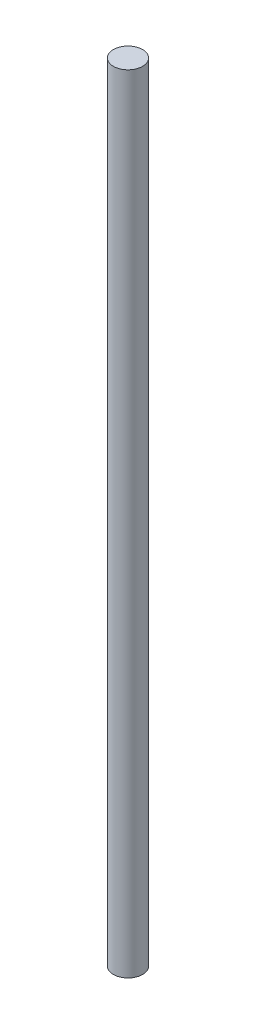
ISO-10303-21;
HEADER;
FILE_DESCRIPTION(('STEP AP214'),'2;1');
FILE_NAME('part.step','',(''),(''),'','','');
FILE_SCHEMA(('AUTOMOTIVE_DESIGN { 1 0 10303 214 1 1 1 1 }'));
ENDSEC;
DATA;
#1=APPLICATION_CONTEXT('core data for automotive mechanical design processes');
#2=APPLICATION_PROTOCOL_DEFINITION('international standard','automotive_design',2000,#1);
#3=PRODUCT_CONTEXT('',#1,'mechanical');
#4=PRODUCT('Part','Part','',(#3));
#5=PRODUCT_RELATED_PRODUCT_CATEGORY('part','',(#4));
#6=PRODUCT_DEFINITION_FORMATION('','',#4);
#7=PRODUCT_DEFINITION_CONTEXT('part definition',#1,'design');
#8=PRODUCT_DEFINITION('design','',#6,#7);
#9=PRODUCT_DEFINITION_SHAPE('','',#8);
#10=(LENGTH_UNIT() NAMED_UNIT(*) SI_UNIT(.MILLI.,.METRE.));
#11=(NAMED_UNIT(*) PLANE_ANGLE_UNIT() SI_UNIT($,.RADIAN.));
#12=(NAMED_UNIT(*) SI_UNIT($,.STERADIAN.) SOLID_ANGLE_UNIT());
#13=UNCERTAINTY_MEASURE_WITH_UNIT(LENGTH_MEASURE(1.E-05),#10,'distance_accuracy_value','');
#14=(GEOMETRIC_REPRESENTATION_CONTEXT(3) GLOBAL_UNCERTAINTY_ASSIGNED_CONTEXT((#13)) GLOBAL_UNIT_ASSIGNED_CONTEXT((#10,
#11,#12)) REPRESENTATION_CONTEXT('',''));
#15=CARTESIAN_POINT('',(0.,0.,0.));
#16=DIRECTION('',(0.,0.,1.));
#17=DIRECTION('',(1.,0.,0.));
#18=AXIS2_PLACEMENT_3D('',#15,#16,#17);
#19=CARTESIAN_POINT('',(0.,49276.,0.));
#20=DIRECTION('',(0.,-1.,0.));
#21=DIRECTION('',(0.,0.,-1.));
#22=AXIS2_PLACEMENT_3D('',#19,#20,#21);
#23=CYLINDRICAL_SURFACE('',#22,914.4);
#24=CARTESIAN_POINT('',(0.,49276.,0.));
#25=DIRECTION('',(0.,1.,0.));
#26=DIRECTION('',(0.,0.,1.));
#27=AXIS2_PLACEMENT_3D('',#24,#25,#26);
#28=CIRCLE('',#27,914.4);
#29=CARTESIAN_POINT('',(0.,49276.,914.4));
#30=VERTEX_POINT('',#29);
#31=EDGE_CURVE('E10',#30,#30,#28,.T.);
#32=ORIENTED_EDGE('',*,*,#31,.F.);
#33=EDGE_LOOP('',(#32));
#34=FACE_BOUND('',#33,.T.);
#35=CARTESIAN_POINT('',(0.,0.,0.));
#36=DIRECTION('',(0.,1.,0.));
#37=DIRECTION('',(0.,0.,1.));
#38=AXIS2_PLACEMENT_3D('',#35,#36,#37);
#39=CIRCLE('',#38,914.4);
#40=CARTESIAN_POINT('',(0.,0.,914.4));
#41=VERTEX_POINT('',#40);
#42=EDGE_CURVE('E40',#41,#41,#39,.T.);
#43=ORIENTED_EDGE('',*,*,#42,.T.);
#44=EDGE_LOOP('',(#43));
#45=FACE_BOUND('',#44,.T.);
#46=ADVANCED_FACE('F37',(#34,#45),#23,.T.);
#47=CARTESIAN_POINT('',(0.,49276.,0.));
#48=DIRECTION('',(0.,1.,0.));
#49=DIRECTION('',(0.,0.,1.));
#50=AXIS2_PLACEMENT_3D('',#47,#48,#49);
#51=PLANE('',#50);
#52=ORIENTED_EDGE('',*,*,#31,.T.);
#53=EDGE_LOOP('',(#52));
#54=FACE_BOUND('',#53,.T.);
#55=ADVANCED_FACE('F54',(#54),#51,.T.);
#56=CARTESIAN_POINT('',(0.,0.,0.));
#57=DIRECTION('',(0.,1.,0.));
#58=DIRECTION('',(0.,0.,1.));
#59=AXIS2_PLACEMENT_3D('',#56,#57,#58);
#60=PLANE('',#59);
#61=ORIENTED_EDGE('',*,*,#42,.F.);
#62=EDGE_LOOP('',(#61));
#63=FACE_BOUND('',#62,.T.);
#64=ADVANCED_FACE('F52',(#63),#60,.F.);
#65=CLOSED_SHELL('',(#46,#55,#64));
#66=MANIFOLD_SOLID_BREP('B2',#65);
#67=ADVANCED_BREP_SHAPE_REPRESENTATION('',(#18,#66),#14);
#68=SHAPE_DEFINITION_REPRESENTATION(#9,#67);
ENDSEC;
END-ISO-10303-21;
